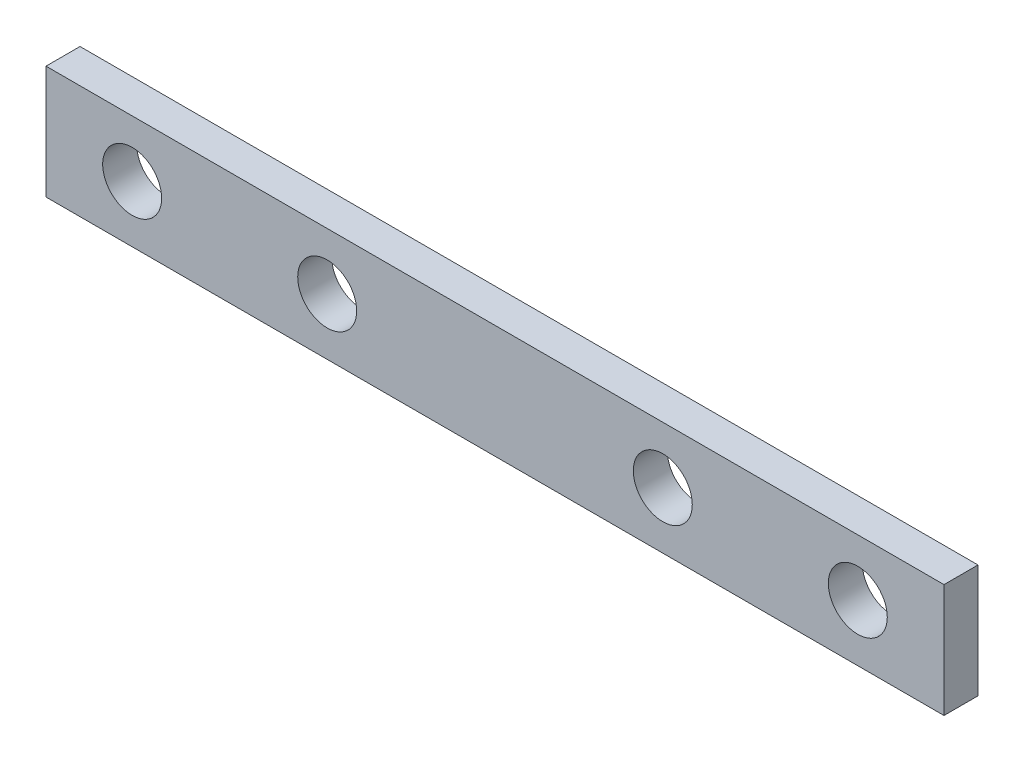
ISO-10303-21;
HEADER;
FILE_DESCRIPTION(('STEP AP214'),'2;1');
FILE_NAME('part.step','',(''),(''),'','','');
FILE_SCHEMA(('AUTOMOTIVE_DESIGN { 1 0 10303 214 1 1 1 1 }'));
ENDSEC;
DATA;
#1=APPLICATION_CONTEXT('core data for automotive mechanical design processes');
#2=APPLICATION_PROTOCOL_DEFINITION('international standard','automotive_design',2000,#1);
#3=PRODUCT_CONTEXT('',#1,'mechanical');
#4=PRODUCT('Part','Part','',(#3));
#5=PRODUCT_RELATED_PRODUCT_CATEGORY('part','',(#4));
#6=PRODUCT_DEFINITION_FORMATION('','',#4);
#7=PRODUCT_DEFINITION_CONTEXT('part definition',#1,'design');
#8=PRODUCT_DEFINITION('design','',#6,#7);
#9=PRODUCT_DEFINITION_SHAPE('','',#8);
#10=(LENGTH_UNIT() NAMED_UNIT(*) SI_UNIT(.MILLI.,.METRE.));
#11=(NAMED_UNIT(*) PLANE_ANGLE_UNIT() SI_UNIT($,.RADIAN.));
#12=(NAMED_UNIT(*) SI_UNIT($,.STERADIAN.) SOLID_ANGLE_UNIT());
#13=UNCERTAINTY_MEASURE_WITH_UNIT(LENGTH_MEASURE(1.E-05),#10,'distance_accuracy_value','');
#14=(GEOMETRIC_REPRESENTATION_CONTEXT(3) GLOBAL_UNCERTAINTY_ASSIGNED_CONTEXT((#13)) GLOBAL_UNIT_ASSIGNED_CONTEXT((#10,
#11,#12)) REPRESENTATION_CONTEXT('',''));
#15=CARTESIAN_POINT('',(0.,0.,0.));
#16=DIRECTION('',(0.,0.,1.));
#17=DIRECTION('',(1.,0.,0.));
#18=AXIS2_PLACEMENT_3D('',#15,#16,#17);
#19=CARTESIAN_POINT('',(0.,0.,3.81));
#20=DIRECTION('',(0.,0.,1.));
#21=DIRECTION('',(1.,0.,0.));
#22=AXIS2_PLACEMENT_3D('',#19,#20,#21);
#23=PLANE('',#22);
#24=CARTESIAN_POINT('',(-28.7740060623423,-18.3906407969762,3.81));
#25=DIRECTION('',(0.,0.,1.));
#26=DIRECTION('',(1.,0.,0.));
#27=AXIS2_PLACEMENT_3D('',#24,#25,#26);
#28=CIRCLE('',#27,3.302);
#29=CARTESIAN_POINT('',(-25.4720060623423,-18.3906407969762,3.81));
#30=VERTEX_POINT('',#29);
#31=EDGE_CURVE('E127',#30,#30,#28,.F.);
#32=ORIENTED_EDGE('',*,*,#31,.T.);
#33=EDGE_LOOP('',(#32));
#34=FACE_BOUND('',#33,.T.);
#35=CARTESIAN_POINT('',(8.8179939376577,-18.3906407969762,3.81));
#36=DIRECTION('',(0.,0.,1.));
#37=DIRECTION('',(1.,0.,0.));
#38=AXIS2_PLACEMENT_3D('',#35,#36,#37);
#39=CIRCLE('',#38,3.302);
#40=CARTESIAN_POINT('',(12.1199939376577,-18.3906407969762,3.81));
#41=VERTEX_POINT('',#40);
#42=EDGE_CURVE('E124',#41,#41,#39,.F.);
#43=ORIENTED_EDGE('',*,*,#42,.T.);
#44=EDGE_LOOP('',(#43));
#45=FACE_BOUND('',#44,.T.);
#46=CARTESIAN_POINT('',(30.6619939376577,-18.3906407969762,3.81));
#47=DIRECTION('',(0.,0.,1.));
#48=DIRECTION('',(1.,0.,0.));
#49=AXIS2_PLACEMENT_3D('',#46,#47,#48);
#50=CIRCLE('',#49,3.30199999999999);
#51=CARTESIAN_POINT('',(33.9639939376577,-18.3906407969762,3.81));
#52=VERTEX_POINT('',#51);
#53=EDGE_CURVE('E100',#52,#52,#50,.T.);
#54=ORIENTED_EDGE('',*,*,#53,.F.);
#55=EDGE_LOOP('',(#54));
#56=FACE_BOUND('',#55,.T.);
#57=DIRECTION('',(0.,-1.,0.));
#58=VECTOR('',#57,1.);
#59=CARTESIAN_POINT('',(-60.2700060623423,-12.0406407969762,3.81));
#60=LINE('',#59,#58);
#61=CARTESIAN_POINT('',(-60.2700060623423,-12.0406407969762,3.81));
#62=VERTEX_POINT('',#61);
#63=CARTESIAN_POINT('',(-60.2700060623423,-24.7406407969762,3.81));
#64=VERTEX_POINT('',#63);
#65=EDGE_CURVE('E85',#62,#64,#60,.T.);
#66=ORIENTED_EDGE('',*,*,#65,.T.);
#67=DIRECTION('',(1.,0.,0.));
#68=VECTOR('',#67,1.);
#69=CARTESIAN_POINT('',(-60.2700060623423,-24.7406407969762,3.81));
#70=LINE('',#69,#68);
#71=CARTESIAN_POINT('',(40.3139939376577,-24.7406407969762,3.81));
#72=VERTEX_POINT('',#71);
#73=EDGE_CURVE('E80',#64,#72,#70,.T.);
#74=ORIENTED_EDGE('',*,*,#73,.T.);
#75=DIRECTION('',(0.,1.,0.));
#76=VECTOR('',#75,1.);
#77=CARTESIAN_POINT('',(40.3139939376577,-12.0406407969762,3.81));
#78=LINE('',#77,#76);
#79=CARTESIAN_POINT('',(40.3139939376577,-12.0406407969762,3.81));
#80=VERTEX_POINT('',#79);
#81=EDGE_CURVE('E83',#72,#80,#78,.T.);
#82=ORIENTED_EDGE('',*,*,#81,.T.);
#83=DIRECTION('',(-1.,0.,0.));
#84=VECTOR('',#83,1.);
#85=CARTESIAN_POINT('',(-60.2700060623423,-12.0406407969762,3.81));
#86=LINE('',#85,#84);
#87=EDGE_CURVE('E50',#80,#62,#86,.T.);
#88=ORIENTED_EDGE('',*,*,#87,.T.);
#89=EDGE_LOOP('',(#66,#74,#82,#88));
#90=FACE_BOUND('',#89,.T.);
#91=CARTESIAN_POINT('',(-50.6180060623423,-18.3906407969762,3.81));
#92=DIRECTION('',(0.,0.,1.));
#93=DIRECTION('',(1.,0.,0.));
#94=AXIS2_PLACEMENT_3D('',#91,#92,#93);
#95=CIRCLE('',#94,3.302);
#96=CARTESIAN_POINT('',(-47.3160060623423,-18.3906407969762,3.81));
#97=VERTEX_POINT('',#96);
#98=EDGE_CURVE('E115',#97,#97,#95,.T.);
#99=ORIENTED_EDGE('',*,*,#98,.F.);
#100=EDGE_LOOP('',(#99));
#101=FACE_BOUND('',#100,.T.);
#102=ADVANCED_FACE('F33',(#34,#45,#56,#90,#101),#23,.T.);
#103=CARTESIAN_POINT('',(0.,0.,0.));
#104=DIRECTION('',(0.,0.,1.));
#105=DIRECTION('',(1.,0.,0.));
#106=AXIS2_PLACEMENT_3D('',#103,#104,#105);
#107=PLANE('',#106);
#108=CARTESIAN_POINT('',(-28.7740060623423,-18.3906407969762,0.));
#109=DIRECTION('',(0.,0.,-1.));
#110=DIRECTION('',(-1.,0.,0.));
#111=AXIS2_PLACEMENT_3D('',#108,#109,#110);
#112=CIRCLE('',#111,3.302);
#113=CARTESIAN_POINT('',(-32.0760060623423,-18.3906407969762,0.));
#114=VERTEX_POINT('',#113);
#115=EDGE_CURVE('E130',#114,#114,#112,.T.);
#116=ORIENTED_EDGE('',*,*,#115,.F.);
#117=EDGE_LOOP('',(#116));
#118=FACE_BOUND('',#117,.T.);
#119=CARTESIAN_POINT('',(8.8179939376577,-18.3906407969762,0.));
#120=DIRECTION('',(0.,0.,-1.));
#121=DIRECTION('',(-1.,0.,0.));
#122=AXIS2_PLACEMENT_3D('',#119,#120,#121);
#123=CIRCLE('',#122,3.302);
#124=CARTESIAN_POINT('',(5.5159939376577,-18.3906407969762,0.));
#125=VERTEX_POINT('',#124);
#126=EDGE_CURVE('E121',#125,#125,#123,.T.);
#127=ORIENTED_EDGE('',*,*,#126,.F.);
#128=EDGE_LOOP('',(#127));
#129=FACE_BOUND('',#128,.T.);
#130=CARTESIAN_POINT('',(30.6619939376577,-18.3906407969762,0.));
#131=DIRECTION('',(0.,0.,1.));
#132=DIRECTION('',(1.,0.,0.));
#133=AXIS2_PLACEMENT_3D('',#130,#131,#132);
#134=CIRCLE('',#133,3.30199999999999);
#135=CARTESIAN_POINT('',(33.9639939376577,-18.3906407969762,0.));
#136=VERTEX_POINT('',#135);
#137=EDGE_CURVE('E112',#136,#136,#134,.T.);
#138=ORIENTED_EDGE('',*,*,#137,.T.);
#139=EDGE_LOOP('',(#138));
#140=FACE_BOUND('',#139,.T.);
#141=DIRECTION('',(0.,-1.,0.));
#142=VECTOR('',#141,1.);
#143=CARTESIAN_POINT('',(-60.2700060623423,-12.0406407969762,0.));
#144=LINE('',#143,#142);
#145=CARTESIAN_POINT('',(-60.2700060623423,-12.0406407969762,0.));
#146=VERTEX_POINT('',#145);
#147=CARTESIAN_POINT('',(-60.2700060623423,-24.7406407969762,0.));
#148=VERTEX_POINT('',#147);
#149=EDGE_CURVE('E97',#146,#148,#144,.T.);
#150=ORIENTED_EDGE('',*,*,#149,.F.);
#151=DIRECTION('',(-1.,0.,0.));
#152=VECTOR('',#151,1.);
#153=CARTESIAN_POINT('',(-60.2700060623423,-12.0406407969762,0.));
#154=LINE('',#153,#152);
#155=CARTESIAN_POINT('',(40.3139939376577,-12.0406407969762,0.));
#156=VERTEX_POINT('',#155);
#157=EDGE_CURVE('E73',#156,#146,#154,.T.);
#158=ORIENTED_EDGE('',*,*,#157,.F.);
#159=DIRECTION('',(0.,1.,0.));
#160=VECTOR('',#159,1.);
#161=CARTESIAN_POINT('',(40.3139939376577,-12.0406407969762,0.));
#162=LINE('',#161,#160);
#163=CARTESIAN_POINT('',(40.3139939376577,-24.7406407969762,0.));
#164=VERTEX_POINT('',#163);
#165=EDGE_CURVE('E67',#164,#156,#162,.T.);
#166=ORIENTED_EDGE('',*,*,#165,.F.);
#167=DIRECTION('',(1.,0.,0.));
#168=VECTOR('',#167,1.);
#169=CARTESIAN_POINT('',(-60.2700060623423,-24.7406407969762,0.));
#170=LINE('',#169,#168);
#171=EDGE_CURVE('E89',#148,#164,#170,.T.);
#172=ORIENTED_EDGE('',*,*,#171,.F.);
#173=EDGE_LOOP('',(#150,#158,#166,#172));
#174=FACE_BOUND('',#173,.T.);
#175=CARTESIAN_POINT('',(-50.6180060623423,-18.3906407969762,0.));
#176=DIRECTION('',(0.,0.,1.));
#177=DIRECTION('',(1.,0.,0.));
#178=AXIS2_PLACEMENT_3D('',#175,#176,#177);
#179=CIRCLE('',#178,3.302);
#180=CARTESIAN_POINT('',(-47.3160060623423,-18.3906407969762,0.));
#181=VERTEX_POINT('',#180);
#182=EDGE_CURVE('E118',#181,#181,#179,.T.);
#183=ORIENTED_EDGE('',*,*,#182,.T.);
#184=EDGE_LOOP('',(#183));
#185=FACE_BOUND('',#184,.T.);
#186=ADVANCED_FACE('F108',(#118,#129,#140,#174,#185),#107,.F.);
#187=CARTESIAN_POINT('',(-60.2700060623423,-12.0406407969762,3.81));
#188=DIRECTION('',(1.,0.,0.));
#189=DIRECTION('',(0.,0.,-1.));
#190=AXIS2_PLACEMENT_3D('',#187,#188,#189);
#191=PLANE('',#190);
#192=ORIENTED_EDGE('',*,*,#149,.T.);
#193=DIRECTION('',(0.,0.,-1.));
#194=VECTOR('',#193,1.);
#195=CARTESIAN_POINT('',(-60.2700060623423,-24.7406407969762,3.81));
#196=LINE('',#195,#194);
#197=EDGE_CURVE('E11',#64,#148,#196,.T.);
#198=ORIENTED_EDGE('',*,*,#197,.F.);
#199=ORIENTED_EDGE('',*,*,#65,.F.);
#200=DIRECTION('',(0.,0.,-1.));
#201=VECTOR('',#200,1.);
#202=CARTESIAN_POINT('',(-60.2700060623423,-12.0406407969762,3.81));
#203=LINE('',#202,#201);
#204=EDGE_CURVE('E93',#62,#146,#203,.T.);
#205=ORIENTED_EDGE('',*,*,#204,.T.);
#206=EDGE_LOOP('',(#192,#198,#199,#205));
#207=FACE_BOUND('',#206,.T.);
#208=ADVANCED_FACE('F35',(#207),#191,.F.);
#209=CARTESIAN_POINT('',(-60.2700060623423,-24.7406407969762,3.81));
#210=DIRECTION('',(0.,1.,0.));
#211=DIRECTION('',(0.,0.,1.));
#212=AXIS2_PLACEMENT_3D('',#209,#210,#211);
#213=PLANE('',#212);
#214=ORIENTED_EDGE('',*,*,#171,.T.);
#215=DIRECTION('',(0.,0.,-1.));
#216=VECTOR('',#215,1.);
#217=CARTESIAN_POINT('',(40.3139939376577,-24.7406407969762,3.81));
#218=LINE('',#217,#216);
#219=EDGE_CURVE('E42',#72,#164,#218,.T.);
#220=ORIENTED_EDGE('',*,*,#219,.F.);
#221=ORIENTED_EDGE('',*,*,#73,.F.);
#222=ORIENTED_EDGE('',*,*,#197,.T.);
#223=EDGE_LOOP('',(#214,#220,#221,#222));
#224=FACE_BOUND('',#223,.T.);
#225=ADVANCED_FACE('F88',(#224),#213,.F.);
#226=CARTESIAN_POINT('',(40.3139939376577,-12.0406407969762,3.81));
#227=DIRECTION('',(-1.,0.,0.));
#228=DIRECTION('',(0.,-1.,0.));
#229=AXIS2_PLACEMENT_3D('',#226,#227,#228);
#230=PLANE('',#229);
#231=ORIENTED_EDGE('',*,*,#165,.T.);
#232=DIRECTION('',(0.,0.,-1.));
#233=VECTOR('',#232,1.);
#234=CARTESIAN_POINT('',(40.3139939376577,-12.0406407969762,3.81));
#235=LINE('',#234,#233);
#236=EDGE_CURVE('E90',#80,#156,#235,.T.);
#237=ORIENTED_EDGE('',*,*,#236,.F.);
#238=ORIENTED_EDGE('',*,*,#81,.F.);
#239=ORIENTED_EDGE('',*,*,#219,.T.);
#240=EDGE_LOOP('',(#231,#237,#238,#239));
#241=FACE_BOUND('',#240,.T.);
#242=ADVANCED_FACE('F91',(#241),#230,.F.);
#243=CARTESIAN_POINT('',(-60.2700060623423,-12.0406407969762,3.81));
#244=DIRECTION('',(0.,-1.,0.));
#245=DIRECTION('',(0.,0.,-1.));
#246=AXIS2_PLACEMENT_3D('',#243,#244,#245);
#247=PLANE('',#246);
#248=ORIENTED_EDGE('',*,*,#157,.T.);
#249=ORIENTED_EDGE('',*,*,#204,.F.);
#250=ORIENTED_EDGE('',*,*,#87,.F.);
#251=ORIENTED_EDGE('',*,*,#236,.T.);
#252=EDGE_LOOP('',(#248,#249,#250,#251));
#253=FACE_BOUND('',#252,.T.);
#254=ADVANCED_FACE('F105',(#253),#247,.F.);
#255=CARTESIAN_POINT('',(30.6619939376577,-18.3906407969762,3.81));
#256=DIRECTION('',(0.,0.,-1.));
#257=DIRECTION('',(-1.,0.,0.));
#258=AXIS2_PLACEMENT_3D('',#255,#256,#257);
#259=CYLINDRICAL_SURFACE('',#258,3.30199999999999);
#260=ORIENTED_EDGE('',*,*,#53,.T.);
#261=EDGE_LOOP('',(#260));
#262=FACE_BOUND('',#261,.T.);
#263=ORIENTED_EDGE('',*,*,#137,.F.);
#264=EDGE_LOOP('',(#263));
#265=FACE_BOUND('',#264,.T.);
#266=ADVANCED_FACE('F152',(#262,#265),#259,.F.);
#267=CARTESIAN_POINT('',(-50.6180060623423,-18.3906407969762,3.81));
#268=DIRECTION('',(0.,0.,-1.));
#269=DIRECTION('',(-1.,0.,0.));
#270=AXIS2_PLACEMENT_3D('',#267,#268,#269);
#271=CYLINDRICAL_SURFACE('',#270,3.302);
#272=ORIENTED_EDGE('',*,*,#98,.T.);
#273=EDGE_LOOP('',(#272));
#274=FACE_BOUND('',#273,.T.);
#275=ORIENTED_EDGE('',*,*,#182,.F.);
#276=EDGE_LOOP('',(#275));
#277=FACE_BOUND('',#276,.T.);
#278=ADVANCED_FACE('F154',(#274,#277),#271,.F.);
#279=CARTESIAN_POINT('',(8.8179939376577,-18.3906407969762,3.811));
#280=DIRECTION('',(0.,0.,-1.));
#281=DIRECTION('',(-1.,0.,0.));
#282=AXIS2_PLACEMENT_3D('',#279,#280,#281);
#283=CYLINDRICAL_SURFACE('',#282,3.302);
#284=ORIENTED_EDGE('',*,*,#42,.F.);
#285=EDGE_LOOP('',(#284));
#286=FACE_BOUND('',#285,.T.);
#287=ORIENTED_EDGE('',*,*,#126,.T.);
#288=EDGE_LOOP('',(#287));
#289=FACE_BOUND('',#288,.T.);
#290=ADVANCED_FACE('F141',(#286,#289),#283,.F.);
#291=CARTESIAN_POINT('',(-28.7740060623423,-18.3906407969762,3.811));
#292=DIRECTION('',(0.,0.,-1.));
#293=DIRECTION('',(-1.,0.,0.));
#294=AXIS2_PLACEMENT_3D('',#291,#292,#293);
#295=CYLINDRICAL_SURFACE('',#294,3.302);
#296=ORIENTED_EDGE('',*,*,#31,.F.);
#297=EDGE_LOOP('',(#296));
#298=FACE_BOUND('',#297,.T.);
#299=ORIENTED_EDGE('',*,*,#115,.T.);
#300=EDGE_LOOP('',(#299));
#301=FACE_BOUND('',#300,.T.);
#302=ADVANCED_FACE('F138',(#298,#301),#295,.F.);
#303=CLOSED_SHELL('',(#102,#186,#208,#225,#242,#254,#266,#278,#290,#302));
#304=MANIFOLD_SOLID_BREP('B2',#303);
#305=ADVANCED_BREP_SHAPE_REPRESENTATION('',(#18,#304),#14);
#306=SHAPE_DEFINITION_REPRESENTATION(#9,#305);
ENDSEC;
END-ISO-10303-21;
